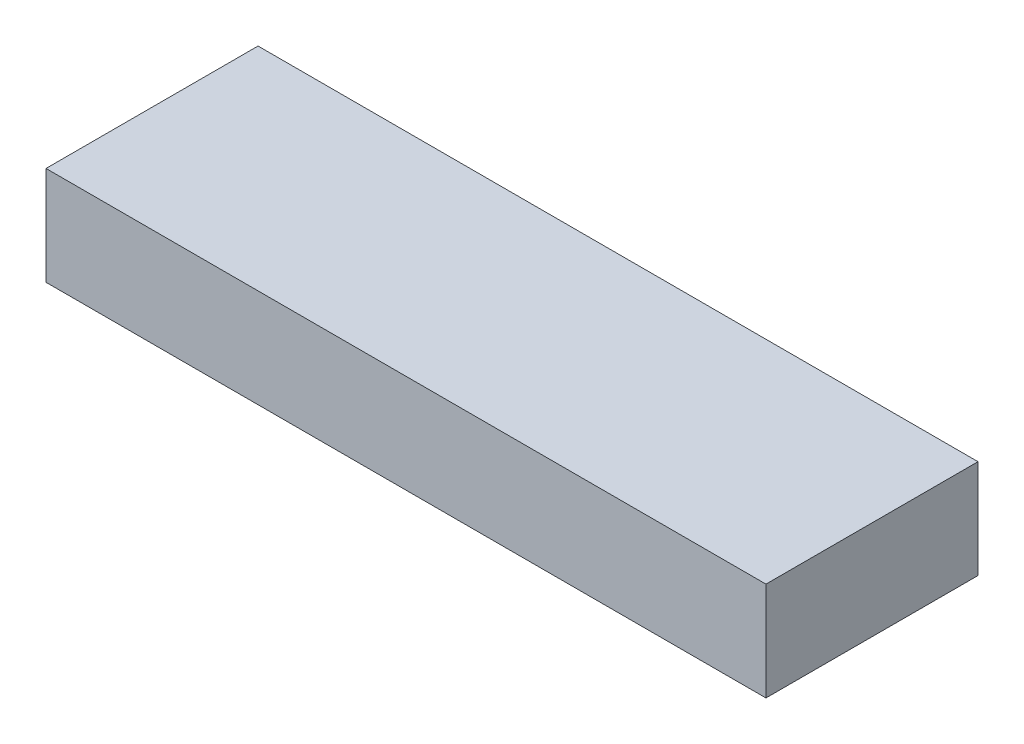
ISO-10303-21;
HEADER;
FILE_DESCRIPTION(('STEP AP214'),'2;1');
FILE_NAME('part.step','',(''),(''),'','','');
FILE_SCHEMA(('AUTOMOTIVE_DESIGN { 1 0 10303 214 1 1 1 1 }'));
ENDSEC;
DATA;
#1=APPLICATION_CONTEXT('core data for automotive mechanical design processes');
#2=APPLICATION_PROTOCOL_DEFINITION('international standard','automotive_design',2000,#1);
#3=PRODUCT_CONTEXT('',#1,'mechanical');
#4=PRODUCT('Part','Part','',(#3));
#5=PRODUCT_RELATED_PRODUCT_CATEGORY('part','',(#4));
#6=PRODUCT_DEFINITION_FORMATION('','',#4);
#7=PRODUCT_DEFINITION_CONTEXT('part definition',#1,'design');
#8=PRODUCT_DEFINITION('design','',#6,#7);
#9=PRODUCT_DEFINITION_SHAPE('','',#8);
#10=(LENGTH_UNIT() NAMED_UNIT(*) SI_UNIT(.MILLI.,.METRE.));
#11=(NAMED_UNIT(*) PLANE_ANGLE_UNIT() SI_UNIT($,.RADIAN.));
#12=(NAMED_UNIT(*) SI_UNIT($,.STERADIAN.) SOLID_ANGLE_UNIT());
#13=UNCERTAINTY_MEASURE_WITH_UNIT(LENGTH_MEASURE(1.E-05),#10,'distance_accuracy_value','');
#14=(GEOMETRIC_REPRESENTATION_CONTEXT(3) GLOBAL_UNCERTAINTY_ASSIGNED_CONTEXT((#13)) GLOBAL_UNIT_ASSIGNED_CONTEXT((#10,
#11,#12)) REPRESENTATION_CONTEXT('',''));
#15=CARTESIAN_POINT('',(0.,0.,0.));
#16=DIRECTION('',(0.,0.,1.));
#17=DIRECTION('',(1.,0.,0.));
#18=AXIS2_PLACEMENT_3D('',#15,#16,#17);
#19=CARTESIAN_POINT('',(73.,20.,21.5));
#20=DIRECTION('',(-1.,0.,0.));
#21=DIRECTION('',(0.,0.,1.));
#22=AXIS2_PLACEMENT_3D('',#19,#20,#21);
#23=PLANE('',#22);
#24=DIRECTION('',(0.,0.,-1.));
#25=VECTOR('',#24,1.);
#26=CARTESIAN_POINT('',(73.,0.,21.5));
#27=LINE('',#26,#25);
#28=CARTESIAN_POINT('',(73.,0.,21.5));
#29=VERTEX_POINT('',#28);
#30=CARTESIAN_POINT('',(73.,0.,-21.5));
#31=VERTEX_POINT('',#30);
#32=EDGE_CURVE('E99',#29,#31,#27,.T.);
#33=ORIENTED_EDGE('',*,*,#32,.T.);
#34=DIRECTION('',(0.,-1.,0.));
#35=VECTOR('',#34,1.);
#36=CARTESIAN_POINT('',(73.,20.,-21.5));
#37=LINE('',#36,#35);
#38=CARTESIAN_POINT('',(73.,20.,-21.5));
#39=VERTEX_POINT('',#38);
#40=EDGE_CURVE('E11',#39,#31,#37,.T.);
#41=ORIENTED_EDGE('',*,*,#40,.F.);
#42=DIRECTION('',(0.,0.,-1.));
#43=VECTOR('',#42,1.);
#44=CARTESIAN_POINT('',(73.,20.,21.5));
#45=LINE('',#44,#43);
#46=CARTESIAN_POINT('',(73.,20.,21.5));
#47=VERTEX_POINT('',#46);
#48=EDGE_CURVE('E87',#47,#39,#45,.T.);
#49=ORIENTED_EDGE('',*,*,#48,.F.);
#50=DIRECTION('',(0.,-1.,0.));
#51=VECTOR('',#50,1.);
#52=CARTESIAN_POINT('',(73.,20.,21.5));
#53=LINE('',#52,#51);
#54=EDGE_CURVE('E95',#47,#29,#53,.T.);
#55=ORIENTED_EDGE('',*,*,#54,.T.);
#56=EDGE_LOOP('',(#33,#41,#49,#55));
#57=FACE_BOUND('',#56,.T.);
#58=ADVANCED_FACE('F36',(#57),#23,.F.);
#59=CARTESIAN_POINT('',(-73.,20.,-21.5));
#60=DIRECTION('',(0.,0.,1.));
#61=DIRECTION('',(1.,0.,0.));
#62=AXIS2_PLACEMENT_3D('',#59,#60,#61);
#63=PLANE('',#62);
#64=DIRECTION('',(-1.,0.,0.));
#65=VECTOR('',#64,1.);
#66=CARTESIAN_POINT('',(-73.,0.,-21.5));
#67=LINE('',#66,#65);
#68=CARTESIAN_POINT('',(-73.,0.,-21.5));
#69=VERTEX_POINT('',#68);
#70=EDGE_CURVE('E91',#31,#69,#67,.T.);
#71=ORIENTED_EDGE('',*,*,#70,.T.);
#72=DIRECTION('',(0.,-1.,0.));
#73=VECTOR('',#72,1.);
#74=CARTESIAN_POINT('',(-73.,20.,-21.5));
#75=LINE('',#74,#73);
#76=CARTESIAN_POINT('',(-73.,20.,-21.5));
#77=VERTEX_POINT('',#76);
#78=EDGE_CURVE('E44',#77,#69,#75,.T.);
#79=ORIENTED_EDGE('',*,*,#78,.F.);
#80=DIRECTION('',(-1.,0.,0.));
#81=VECTOR('',#80,1.);
#82=CARTESIAN_POINT('',(-73.,20.,-21.5));
#83=LINE('',#82,#81);
#84=EDGE_CURVE('E82',#39,#77,#83,.T.);
#85=ORIENTED_EDGE('',*,*,#84,.F.);
#86=ORIENTED_EDGE('',*,*,#40,.T.);
#87=EDGE_LOOP('',(#71,#79,#85,#86));
#88=FACE_BOUND('',#87,.T.);
#89=ADVANCED_FACE('F90',(#88),#63,.F.);
#90=CARTESIAN_POINT('',(-73.,20.,21.5));
#91=DIRECTION('',(1.,0.,0.));
#92=DIRECTION('',(0.,0.,-1.));
#93=AXIS2_PLACEMENT_3D('',#90,#91,#92);
#94=PLANE('',#93);
#95=DIRECTION('',(0.,0.,1.));
#96=VECTOR('',#95,1.);
#97=CARTESIAN_POINT('',(-73.,0.,21.5));
#98=LINE('',#97,#96);
#99=CARTESIAN_POINT('',(-73.,0.,21.5));
#100=VERTEX_POINT('',#99);
#101=EDGE_CURVE('E69',#69,#100,#98,.T.);
#102=ORIENTED_EDGE('',*,*,#101,.T.);
#103=DIRECTION('',(0.,-1.,0.));
#104=VECTOR('',#103,1.);
#105=CARTESIAN_POINT('',(-73.,20.,21.5));
#106=LINE('',#105,#104);
#107=CARTESIAN_POINT('',(-73.,20.,21.5));
#108=VERTEX_POINT('',#107);
#109=EDGE_CURVE('E92',#108,#100,#106,.T.);
#110=ORIENTED_EDGE('',*,*,#109,.F.);
#111=DIRECTION('',(0.,0.,1.));
#112=VECTOR('',#111,1.);
#113=CARTESIAN_POINT('',(-73.,20.,21.5));
#114=LINE('',#113,#112);
#115=EDGE_CURVE('E85',#77,#108,#114,.T.);
#116=ORIENTED_EDGE('',*,*,#115,.F.);
#117=ORIENTED_EDGE('',*,*,#78,.T.);
#118=EDGE_LOOP('',(#102,#110,#116,#117));
#119=FACE_BOUND('',#118,.T.);
#120=ADVANCED_FACE('F93',(#119),#94,.F.);
#121=CARTESIAN_POINT('',(-73.,20.,21.5));
#122=DIRECTION('',(0.,0.,-1.));
#123=DIRECTION('',(-1.,0.,0.));
#124=AXIS2_PLACEMENT_3D('',#121,#122,#123);
#125=PLANE('',#124);
#126=DIRECTION('',(1.,0.,0.));
#127=VECTOR('',#126,1.);
#128=CARTESIAN_POINT('',(-73.,0.,21.5));
#129=LINE('',#128,#127);
#130=EDGE_CURVE('E75',#100,#29,#129,.T.);
#131=ORIENTED_EDGE('',*,*,#130,.T.);
#132=ORIENTED_EDGE('',*,*,#54,.F.);
#133=DIRECTION('',(1.,0.,0.));
#134=VECTOR('',#133,1.);
#135=CARTESIAN_POINT('',(-73.,20.,21.5));
#136=LINE('',#135,#134);
#137=EDGE_CURVE('E52',#108,#47,#136,.T.);
#138=ORIENTED_EDGE('',*,*,#137,.F.);
#139=ORIENTED_EDGE('',*,*,#109,.T.);
#140=EDGE_LOOP('',(#131,#132,#138,#139));
#141=FACE_BOUND('',#140,.T.);
#142=ADVANCED_FACE('F106',(#141),#125,.F.);
#143=CARTESIAN_POINT('',(73.,20.,-21.5));
#144=DIRECTION('',(0.,-1.,0.));
#145=DIRECTION('',(0.,0.,-1.));
#146=AXIS2_PLACEMENT_3D('',#143,#144,#145);
#147=PLANE('',#146);
#148=ORIENTED_EDGE('',*,*,#48,.T.);
#149=ORIENTED_EDGE('',*,*,#84,.T.);
#150=ORIENTED_EDGE('',*,*,#115,.T.);
#151=ORIENTED_EDGE('',*,*,#137,.T.);
#152=EDGE_LOOP('',(#148,#149,#150,#151));
#153=FACE_BOUND('',#152,.T.);
#154=ADVANCED_FACE('F83',(#153),#147,.F.);
#155=CARTESIAN_POINT('',(73.,0.,-21.5));
#156=DIRECTION('',(0.,-1.,0.));
#157=DIRECTION('',(0.,0.,-1.));
#158=AXIS2_PLACEMENT_3D('',#155,#156,#157);
#159=PLANE('',#158);
#160=ORIENTED_EDGE('',*,*,#32,.F.);
#161=ORIENTED_EDGE('',*,*,#130,.F.);
#162=ORIENTED_EDGE('',*,*,#101,.F.);
#163=ORIENTED_EDGE('',*,*,#70,.F.);
#164=EDGE_LOOP('',(#160,#161,#162,#163));
#165=FACE_BOUND('',#164,.T.);
#166=ADVANCED_FACE('F109',(#165),#159,.T.);
#167=CLOSED_SHELL('',(#58,#89,#120,#142,#154,#166));
#168=MANIFOLD_SOLID_BREP('B2',#167);
#169=ADVANCED_BREP_SHAPE_REPRESENTATION('',(#18,#168),#14);
#170=SHAPE_DEFINITION_REPRESENTATION(#9,#169);
ENDSEC;
END-ISO-10303-21;
